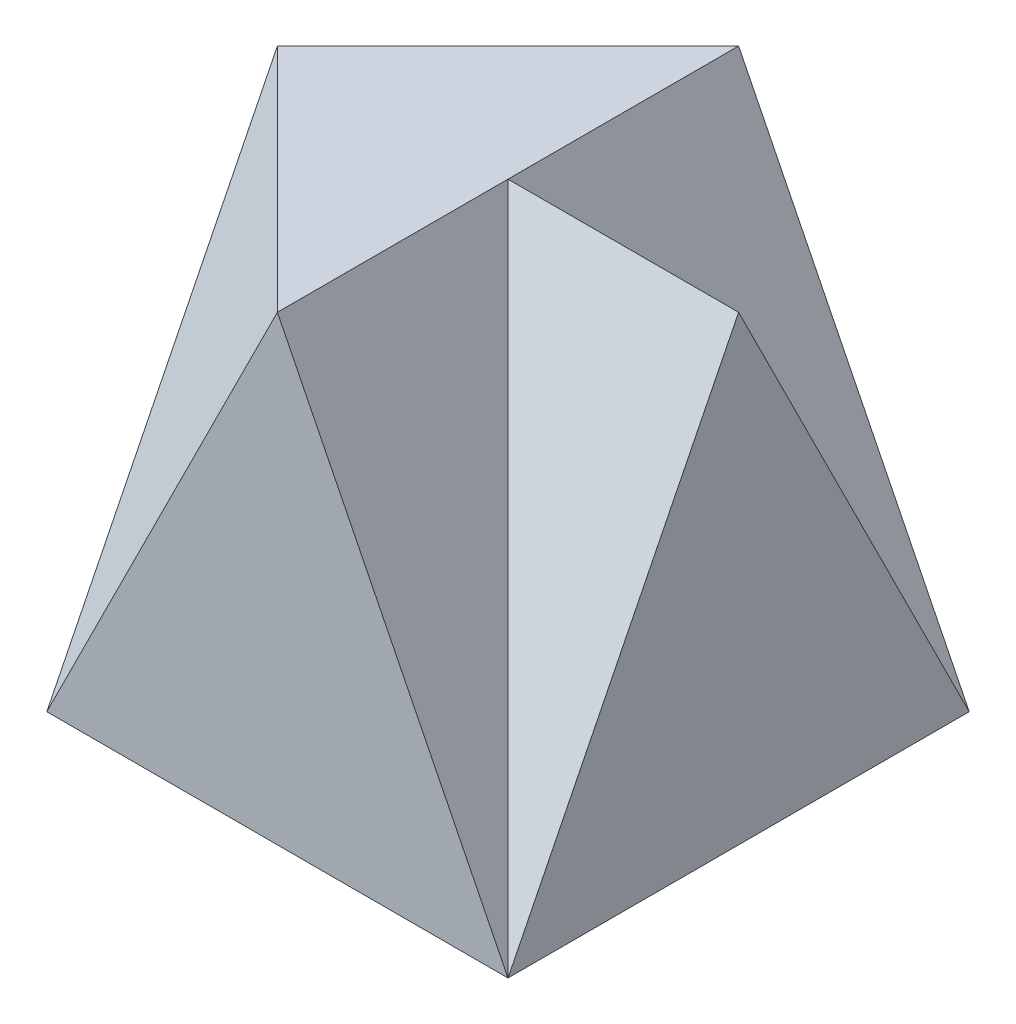
ISO-10303-21;
HEADER;
FILE_DESCRIPTION(('STEP AP214'),'2;1');
FILE_NAME('part.step','',(''),(''),'','','');
FILE_SCHEMA(('AUTOMOTIVE_DESIGN { 1 0 10303 214 1 1 1 1 }'));
ENDSEC;
DATA;
#1=APPLICATION_CONTEXT('core data for automotive mechanical design processes');
#2=APPLICATION_PROTOCOL_DEFINITION('international standard','automotive_design',2000,#1);
#3=PRODUCT_CONTEXT('',#1,'mechanical');
#4=PRODUCT('Part','Part','',(#3));
#5=PRODUCT_RELATED_PRODUCT_CATEGORY('part','',(#4));
#6=PRODUCT_DEFINITION_FORMATION('','',#4);
#7=PRODUCT_DEFINITION_CONTEXT('part definition',#1,'design');
#8=PRODUCT_DEFINITION('design','',#6,#7);
#9=PRODUCT_DEFINITION_SHAPE('','',#8);
#10=(LENGTH_UNIT() NAMED_UNIT(*) SI_UNIT(.MILLI.,.METRE.));
#11=(NAMED_UNIT(*) PLANE_ANGLE_UNIT() SI_UNIT($,.RADIAN.));
#12=(NAMED_UNIT(*) SI_UNIT($,.STERADIAN.) SOLID_ANGLE_UNIT());
#13=UNCERTAINTY_MEASURE_WITH_UNIT(LENGTH_MEASURE(1.E-05),#10,'distance_accuracy_value','');
#14=(GEOMETRIC_REPRESENTATION_CONTEXT(3) GLOBAL_UNCERTAINTY_ASSIGNED_CONTEXT((#13)) GLOBAL_UNIT_ASSIGNED_CONTEXT((#10,
#11,#12)) REPRESENTATION_CONTEXT('',''));
#15=CARTESIAN_POINT('',(0.,0.,0.));
#16=DIRECTION('',(0.,0.,1.));
#17=DIRECTION('',(1.,0.,0.));
#18=AXIS2_PLACEMENT_3D('',#15,#16,#17);
#19=CARTESIAN_POINT('',(0.,4.,0.));
#20=DIRECTION('',(0.,-1.,0.));
#21=DIRECTION('',(0.,0.,-1.));
#22=AXIS2_PLACEMENT_3D('',#19,#20,#21);
#23=PLANE('',#22);
#24=DIRECTION('',(0.,0.,-1.));
#25=VECTOR('',#24,1.);
#26=CARTESIAN_POINT('',(0.,4.,0.));
#27=LINE('',#26,#25);
#28=CARTESIAN_POINT('',(0.,4.,0.));
#29=VERTEX_POINT('',#28);
#30=CARTESIAN_POINT('',(0.,4.,-2.));
#31=VERTEX_POINT('',#30);
#32=EDGE_CURVE('E101',#29,#31,#27,.T.);
#33=ORIENTED_EDGE('',*,*,#32,.T.);
#34=DIRECTION('',(-0.707106781186548,0.,0.707106781186548));
#35=VECTOR('',#34,1.);
#36=CARTESIAN_POINT('',(0.,4.,-2.));
#37=LINE('',#36,#35);
#38=CARTESIAN_POINT('',(-2.,4.,0.));
#39=VERTEX_POINT('',#38);
#40=EDGE_CURVE('E127',#31,#39,#37,.T.);
#41=ORIENTED_EDGE('',*,*,#40,.T.);
#42=DIRECTION('',(-0.707106781186548,0.,-0.707106781186548));
#43=VECTOR('',#42,1.);
#44=CARTESIAN_POINT('',(0.,4.,2.));
#45=LINE('',#44,#43);
#46=CARTESIAN_POINT('',(0.,4.,2.));
#47=VERTEX_POINT('',#46);
#48=EDGE_CURVE('E140',#47,#39,#45,.T.);
#49=ORIENTED_EDGE('',*,*,#48,.F.);
#50=DIRECTION('',(0.,0.,1.));
#51=VECTOR('',#50,1.);
#52=CARTESIAN_POINT('',(0.,4.,0.));
#53=LINE('',#52,#51);
#54=EDGE_CURVE('E93',#29,#47,#53,.T.);
#55=ORIENTED_EDGE('',*,*,#54,.F.);
#56=EDGE_LOOP('',(#33,#41,#49,#55));
#57=FACE_BOUND('',#56,.T.);
#58=ADVANCED_FACE('F37',(#57),#23,.F.);
#59=CARTESIAN_POINT('',(-2.,4.,-2.));
#60=DIRECTION('',(0.,0.,1.));
#61=DIRECTION('',(1.,0.,0.));
#62=AXIS2_PLACEMENT_3D('',#59,#60,#61);
#63=PLANE('',#62);
#64=DIRECTION('',(-0.447213595499958,0.894427190999916,0.));
#65=VECTOR('',#64,1.);
#66=CARTESIAN_POINT('',(-0.399999999999999,4.8,-2.));
#67=LINE('',#66,#65);
#68=CARTESIAN_POINT('',(2.,0.,-2.));
#69=VERTEX_POINT('',#68);
#70=EDGE_CURVE('E104',#69,#31,#67,.T.);
#71=ORIENTED_EDGE('',*,*,#70,.F.);
#72=DIRECTION('',(-1.,0.,0.));
#73=VECTOR('',#72,1.);
#74=CARTESIAN_POINT('',(-2.,0.,-2.));
#75=LINE('',#74,#73);
#76=CARTESIAN_POINT('',(-2.,0.,-2.));
#77=VERTEX_POINT('',#76);
#78=EDGE_CURVE('E149',#69,#77,#75,.T.);
#79=ORIENTED_EDGE('',*,*,#78,.T.);
#80=DIRECTION('',(0.447213595499958,0.894427190999916,0.));
#81=VECTOR('',#80,1.);
#82=CARTESIAN_POINT('',(-2.,0.,-2.));
#83=LINE('',#82,#81);
#84=EDGE_CURVE('E119',#77,#31,#83,.T.);
#85=ORIENTED_EDGE('',*,*,#84,.T.);
#86=EDGE_LOOP('',(#71,#79,#85));
#87=FACE_BOUND('',#86,.T.);
#88=ADVANCED_FACE('F161',(#87),#63,.F.);
#89=CARTESIAN_POINT('',(-2.,4.,2.));
#90=DIRECTION('',(0.,0.,-1.));
#91=DIRECTION('',(-1.,0.,0.));
#92=AXIS2_PLACEMENT_3D('',#89,#90,#91);
#93=PLANE('',#92);
#94=DIRECTION('',(0.447213595499958,-0.894427190999916,0.));
#95=VECTOR('',#94,1.);
#96=CARTESIAN_POINT('',(-0.399999999999999,4.8,2.));
#97=LINE('',#96,#95);
#98=CARTESIAN_POINT('',(2.,0.,2.));
#99=VERTEX_POINT('',#98);
#100=EDGE_CURVE('E92',#47,#99,#97,.T.);
#101=ORIENTED_EDGE('',*,*,#100,.F.);
#102=DIRECTION('',(0.447213595499958,0.894427190999916,0.));
#103=VECTOR('',#102,1.);
#104=CARTESIAN_POINT('',(-2.,0.,2.));
#105=LINE('',#104,#103);
#106=CARTESIAN_POINT('',(-2.,0.,2.));
#107=VERTEX_POINT('',#106);
#108=EDGE_CURVE('E130',#107,#47,#105,.T.);
#109=ORIENTED_EDGE('',*,*,#108,.F.);
#110=DIRECTION('',(1.,0.,0.));
#111=VECTOR('',#110,1.);
#112=CARTESIAN_POINT('',(-2.,0.,2.));
#113=LINE('',#112,#111);
#114=EDGE_CURVE('E12',#107,#99,#113,.T.);
#115=ORIENTED_EDGE('',*,*,#114,.T.);
#116=EDGE_LOOP('',(#101,#109,#115));
#117=FACE_BOUND('',#116,.T.);
#118=ADVANCED_FACE('F177',(#117),#93,.F.);
#119=CARTESIAN_POINT('',(2.,4.,2.));
#120=DIRECTION('',(-1.,0.,0.));
#121=DIRECTION('',(0.,0.,1.));
#122=AXIS2_PLACEMENT_3D('',#119,#120,#121);
#123=PLANE('',#122);
#124=DIRECTION('',(0.,0.,-1.));
#125=VECTOR('',#124,1.);
#126=CARTESIAN_POINT('',(2.,0.,2.));
#127=LINE('',#126,#125);
#128=EDGE_CURVE('E100',#99,#69,#127,.T.);
#129=ORIENTED_EDGE('',*,*,#128,.T.);
#130=DIRECTION('',(0.,0.894427190999916,0.447213595499958));
#131=VECTOR('',#130,1.);
#132=CARTESIAN_POINT('',(2.,0.,-2.));
#133=LINE('',#132,#131);
#134=CARTESIAN_POINT('',(2.,4.,0.));
#135=VERTEX_POINT('',#134);
#136=EDGE_CURVE('E89',#69,#135,#133,.T.);
#137=ORIENTED_EDGE('',*,*,#136,.T.);
#138=DIRECTION('',(0.,-0.894427190999916,0.447213595499958));
#139=VECTOR('',#138,1.);
#140=CARTESIAN_POINT('',(2.,4.,0.));
#141=LINE('',#140,#139);
#142=EDGE_CURVE('E98',#135,#99,#141,.T.);
#143=ORIENTED_EDGE('',*,*,#142,.T.);
#144=EDGE_LOOP('',(#129,#137,#143));
#145=FACE_BOUND('',#144,.T.);
#146=ADVANCED_FACE('F39',(#145),#123,.F.);
#147=CARTESIAN_POINT('',(-2.,4.,2.));
#148=DIRECTION('',(1.,0.,0.));
#149=DIRECTION('',(0.,0.,-1.));
#150=AXIS2_PLACEMENT_3D('',#147,#148,#149);
#151=PLANE('',#150);
#152=DIRECTION('',(0.,-0.894427190999916,-0.447213595499958));
#153=VECTOR('',#152,1.);
#154=CARTESIAN_POINT('',(-2.,4.,0.));
#155=LINE('',#154,#153);
#156=EDGE_CURVE('E124',#39,#77,#155,.T.);
#157=ORIENTED_EDGE('',*,*,#156,.T.);
#158=DIRECTION('',(0.,0.,1.));
#159=VECTOR('',#158,1.);
#160=CARTESIAN_POINT('',(-2.,0.,2.));
#161=LINE('',#160,#159);
#162=EDGE_CURVE('E46',#77,#107,#161,.T.);
#163=ORIENTED_EDGE('',*,*,#162,.T.);
#164=DIRECTION('',(0.,-0.894427190999916,0.447213595499958));
#165=VECTOR('',#164,1.);
#166=CARTESIAN_POINT('',(-2.,4.,0.));
#167=LINE('',#166,#165);
#168=EDGE_CURVE('E62',#39,#107,#167,.T.);
#169=ORIENTED_EDGE('',*,*,#168,.F.);
#170=EDGE_LOOP('',(#157,#163,#169));
#171=FACE_BOUND('',#170,.T.);
#172=ADVANCED_FACE('F166',(#171),#151,.F.);
#173=CARTESIAN_POINT('',(0.,0.,0.));
#174=DIRECTION('',(0.,-1.,0.));
#175=DIRECTION('',(0.,0.,-1.));
#176=AXIS2_PLACEMENT_3D('',#173,#174,#175);
#177=PLANE('',#176);
#178=ORIENTED_EDGE('',*,*,#128,.F.);
#179=ORIENTED_EDGE('',*,*,#114,.F.);
#180=ORIENTED_EDGE('',*,*,#162,.F.);
#181=ORIENTED_EDGE('',*,*,#78,.F.);
#182=EDGE_LOOP('',(#178,#179,#180,#181));
#183=FACE_BOUND('',#182,.T.);
#184=ADVANCED_FACE('F164',(#183),#177,.T.);
#185=CARTESIAN_POINT('',(-1.77777777777778,0.88888888888889,1.77777777777778));
#186=DIRECTION('',(-0.666666666666667,0.333333333333334,0.666666666666666));
#187=DIRECTION('',(0.707106781186547,0.,0.707106781186548));
#188=AXIS2_PLACEMENT_3D('',#185,#186,#187);
#189=PLANE('',#188);
#190=ORIENTED_EDGE('',*,*,#108,.T.);
#191=ORIENTED_EDGE('',*,*,#48,.T.);
#192=ORIENTED_EDGE('',*,*,#168,.T.);
#193=EDGE_LOOP('',(#190,#191,#192));
#194=FACE_BOUND('',#193,.T.);
#195=ADVANCED_FACE('F174',(#194),#189,.T.);
#196=CARTESIAN_POINT('',(-1.77777777777778,0.888888888888889,-1.77777777777778));
#197=DIRECTION('',(-0.666666666666667,0.333333333333334,-0.666666666666666));
#198=DIRECTION('',(-0.707106781186547,0.,0.707106781186548));
#199=AXIS2_PLACEMENT_3D('',#196,#197,#198);
#200=PLANE('',#199);
#201=ORIENTED_EDGE('',*,*,#40,.F.);
#202=ORIENTED_EDGE('',*,*,#84,.F.);
#203=ORIENTED_EDGE('',*,*,#156,.F.);
#204=EDGE_LOOP('',(#201,#202,#203));
#205=FACE_BOUND('',#204,.T.);
#206=ADVANCED_FACE('F169',(#205),#200,.T.);
#207=CARTESIAN_POINT('',(2.,0.,2.));
#208=DIRECTION('',(0.894427190999916,0.447213595499958,0.));
#209=DIRECTION('',(-0.447213595499958,0.894427190999916,0.));
#210=AXIS2_PLACEMENT_3D('',#207,#208,#209);
#211=PLANE('',#210);
#212=ORIENTED_EDGE('',*,*,#100,.T.);
#213=DIRECTION('',(-0.408248290463863,0.816496580927726,-0.408248290463863));
#214=VECTOR('',#213,1.);
#215=CARTESIAN_POINT('',(2.,0.,2.));
#216=LINE('',#215,#214);
#217=EDGE_CURVE('E54',#99,#29,#216,.T.);
#218=ORIENTED_EDGE('',*,*,#217,.T.);
#219=ORIENTED_EDGE('',*,*,#54,.T.);
#220=EDGE_LOOP('',(#212,#218,#219));
#221=FACE_BOUND('',#220,.T.);
#222=ADVANCED_FACE('F179',(#221),#211,.T.);
#223=CARTESIAN_POINT('',(0.,0.799999999999999,1.6));
#224=DIRECTION('',(0.,0.447213595499958,0.894427190999916));
#225=DIRECTION('',(0.,-0.894427190999916,0.447213595499958));
#226=AXIS2_PLACEMENT_3D('',#223,#224,#225);
#227=PLANE('',#226);
#228=ORIENTED_EDGE('',*,*,#142,.F.);
#229=DIRECTION('',(-1.,0.,0.));
#230=VECTOR('',#229,1.);
#231=CARTESIAN_POINT('',(2.,4.,0.));
#232=LINE('',#231,#230);
#233=EDGE_CURVE('E86',#135,#29,#232,.T.);
#234=ORIENTED_EDGE('',*,*,#233,.T.);
#235=ORIENTED_EDGE('',*,*,#217,.F.);
#236=EDGE_LOOP('',(#228,#234,#235));
#237=FACE_BOUND('',#236,.T.);
#238=ADVANCED_FACE('F103',(#237),#227,.T.);
#239=CARTESIAN_POINT('',(0.,4.,0.));
#240=DIRECTION('',(0.894427190999916,0.447213595499958,0.));
#241=DIRECTION('',(-0.447213595499958,0.894427190999916,0.));
#242=AXIS2_PLACEMENT_3D('',#239,#240,#241);
#243=PLANE('',#242);
#244=ORIENTED_EDGE('',*,*,#70,.T.);
#245=ORIENTED_EDGE('',*,*,#32,.F.);
#246=DIRECTION('',(0.408248290463863,-0.816496580927726,-0.408248290463863));
#247=VECTOR('',#246,1.);
#248=CARTESIAN_POINT('',(0.,4.,0.));
#249=LINE('',#248,#247);
#250=EDGE_CURVE('E91',#29,#69,#249,.T.);
#251=ORIENTED_EDGE('',*,*,#250,.T.);
#252=EDGE_LOOP('',(#244,#245,#251));
#253=FACE_BOUND('',#252,.T.);
#254=ADVANCED_FACE('F186',(#253),#243,.T.);
#255=CARTESIAN_POINT('',(0.,0.800000000000001,-1.6));
#256=DIRECTION('',(0.,-0.447213595499958,0.894427190999916));
#257=DIRECTION('',(0.,-0.894427190999916,-0.447213595499958));
#258=AXIS2_PLACEMENT_3D('',#255,#256,#257);
#259=PLANE('',#258);
#260=ORIENTED_EDGE('',*,*,#136,.F.);
#261=ORIENTED_EDGE('',*,*,#250,.F.);
#262=ORIENTED_EDGE('',*,*,#233,.F.);
#263=EDGE_LOOP('',(#260,#261,#262));
#264=FACE_BOUND('',#263,.T.);
#265=ADVANCED_FACE('F88',(#264),#259,.F.);
#266=CLOSED_SHELL('',(#58,#88,#118,#146,#172,#184,#195,#206,#222,#238,#254,#265));
#267=MANIFOLD_SOLID_BREP('B2',#266);
#268=ADVANCED_BREP_SHAPE_REPRESENTATION('',(#18,#267),#14);
#269=SHAPE_DEFINITION_REPRESENTATION(#9,#268);
ENDSEC;
END-ISO-10303-21;
